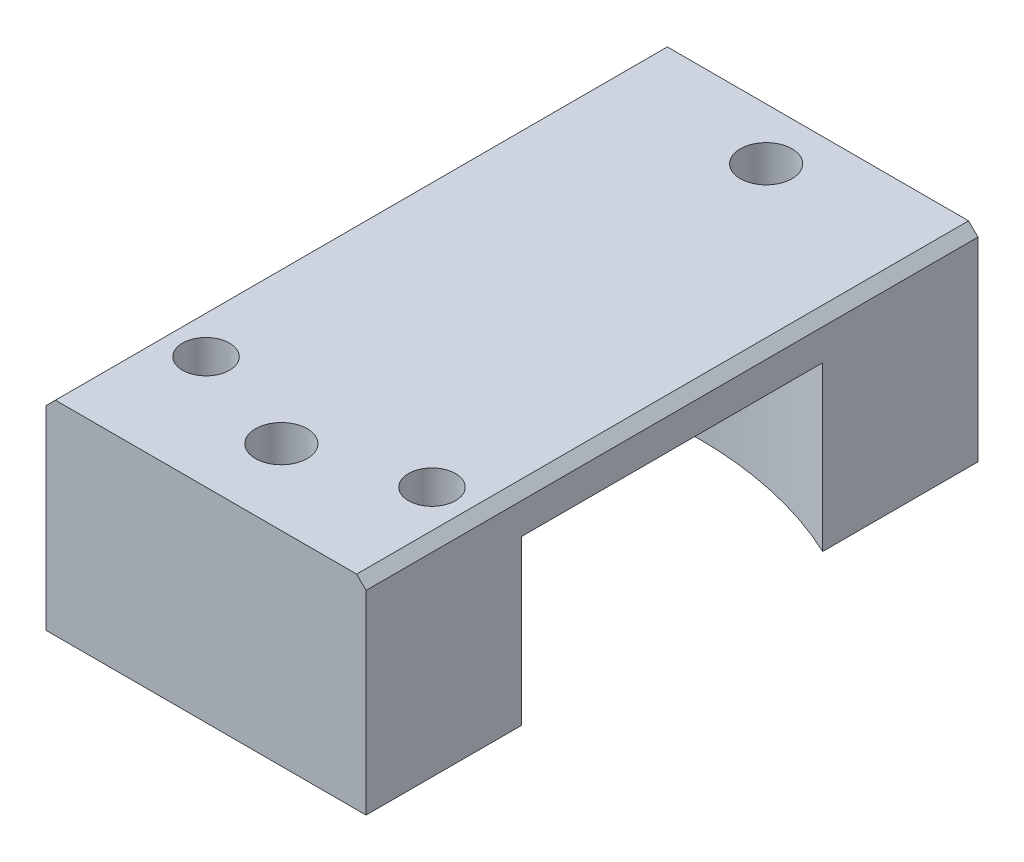
ISO-10303-21;
HEADER;
FILE_DESCRIPTION(('STEP AP214'),'2;1');
FILE_NAME('part.step','',(''),(''),'','','');
FILE_SCHEMA(('AUTOMOTIVE_DESIGN { 1 0 10303 214 1 1 1 1 }'));
ENDSEC;
DATA;
#1=APPLICATION_CONTEXT('core data for automotive mechanical design processes');
#2=APPLICATION_PROTOCOL_DEFINITION('international standard','automotive_design',2000,#1);
#3=PRODUCT_CONTEXT('',#1,'mechanical');
#4=PRODUCT('Part','Part','',(#3));
#5=PRODUCT_RELATED_PRODUCT_CATEGORY('part','',(#4));
#6=PRODUCT_DEFINITION_FORMATION('','',#4);
#7=PRODUCT_DEFINITION_CONTEXT('part definition',#1,'design');
#8=PRODUCT_DEFINITION('design','',#6,#7);
#9=PRODUCT_DEFINITION_SHAPE('','',#8);
#10=(LENGTH_UNIT() NAMED_UNIT(*) SI_UNIT(.MILLI.,.METRE.));
#11=(NAMED_UNIT(*) PLANE_ANGLE_UNIT() SI_UNIT($,.RADIAN.));
#12=(NAMED_UNIT(*) SI_UNIT($,.STERADIAN.) SOLID_ANGLE_UNIT());
#13=UNCERTAINTY_MEASURE_WITH_UNIT(LENGTH_MEASURE(1.E-05),#10,'distance_accuracy_value','');
#14=(GEOMETRIC_REPRESENTATION_CONTEXT(3) GLOBAL_UNCERTAINTY_ASSIGNED_CONTEXT((#13)) GLOBAL_UNIT_ASSIGNED_CONTEXT((#10,
#11,#12)) REPRESENTATION_CONTEXT('',''));
#15=CARTESIAN_POINT('',(0.,0.,0.));
#16=DIRECTION('',(0.,0.,1.));
#17=DIRECTION('',(1.,0.,0.));
#18=AXIS2_PLACEMENT_3D('',#15,#16,#17);
#19=CARTESIAN_POINT('',(0.,0.,65.));
#20=DIRECTION('',(0.,0.,1.));
#21=DIRECTION('',(1.,0.,0.));
#22=AXIS2_PLACEMENT_3D('',#19,#20,#21);
#23=PLANE('',#22);
#24=DIRECTION('',(0.,-1.,0.));
#25=VECTOR('',#24,1.);
#26=CARTESIAN_POINT('',(-17.,52.5,65.));
#27=LINE('',#26,#25);
#28=CARTESIAN_POINT('',(-17.,-29.,65.));
#29=VERTEX_POINT('',#28);
#30=CARTESIAN_POINT('',(-17.,-49.6714203541634,65.));
#31=VERTEX_POINT('',#30);
#32=EDGE_CURVE('E142',#29,#31,#27,.T.);
#33=ORIENTED_EDGE('',*,*,#32,.T.);
#34=DIRECTION('',(1.,0.,0.));
#35=VECTOR('',#34,1.);
#36=CARTESIAN_POINT('',(-17.,-49.6714203541634,65.));
#37=LINE('',#36,#35);
#38=CARTESIAN_POINT('',(17.,-49.6714203541634,65.));
#39=VERTEX_POINT('',#38);
#40=EDGE_CURVE('E124',#31,#39,#37,.T.);
#41=ORIENTED_EDGE('',*,*,#40,.T.);
#42=DIRECTION('',(0.,-1.,0.));
#43=VECTOR('',#42,1.);
#44=CARTESIAN_POINT('',(17.,52.5,65.));
#45=LINE('',#44,#43);
#46=CARTESIAN_POINT('',(17.,-29.,65.));
#47=VERTEX_POINT('',#46);
#48=EDGE_CURVE('E164',#47,#39,#45,.T.);
#49=ORIENTED_EDGE('',*,*,#48,.F.);
#50=DIRECTION('',(0.707106781186544,-0.707106781186551,0.));
#51=VECTOR('',#50,1.);
#52=CARTESIAN_POINT('',(-5.99999999999991,-5.99999999999985,65.));
#53=LINE('',#52,#51);
#54=CARTESIAN_POINT('',(16.,-28.,65.));
#55=VERTEX_POINT('',#54);
#56=EDGE_CURVE('E177',#47,#55,#53,.F.);
#57=ORIENTED_EDGE('',*,*,#56,.T.);
#58=DIRECTION('',(1.,0.,0.));
#59=VECTOR('',#58,1.);
#60=CARTESIAN_POINT('',(-17.,-28.,65.));
#61=LINE('',#60,#59);
#62=CARTESIAN_POINT('',(-16.,-28.,65.));
#63=VERTEX_POINT('',#62);
#64=EDGE_CURVE('E151',#63,#55,#61,.T.);
#65=ORIENTED_EDGE('',*,*,#64,.F.);
#66=DIRECTION('',(0.707106781186548,0.707106781186548,0.));
#67=VECTOR('',#66,1.);
#68=CARTESIAN_POINT('',(6.,-6.,65.));
#69=LINE('',#68,#67);
#70=EDGE_CURVE('E150',#63,#29,#69,.F.);
#71=ORIENTED_EDGE('',*,*,#70,.T.);
#72=EDGE_LOOP('',(#33,#41,#49,#57,#65,#71));
#73=FACE_BOUND('',#72,.T.);
#74=ADVANCED_FACE('F36',(#73),#23,.T.);
#75=CARTESIAN_POINT('',(0.,0.,0.));
#76=DIRECTION('',(0.,0.,1.));
#77=DIRECTION('',(1.,0.,0.));
#78=AXIS2_PLACEMENT_3D('',#75,#76,#77);
#79=PLANE('',#78);
#80=DIRECTION('',(-1.,0.,0.));
#81=VECTOR('',#80,1.);
#82=CARTESIAN_POINT('',(-17.,-49.6714203541634,0.));
#83=LINE('',#82,#81);
#84=CARTESIAN_POINT('',(17.,-49.6714203541634,0.));
#85=VERTEX_POINT('',#84);
#86=CARTESIAN_POINT('',(-17.,-49.6714203541634,0.));
#87=VERTEX_POINT('',#86);
#88=EDGE_CURVE('E134',#85,#87,#83,.T.);
#89=ORIENTED_EDGE('',*,*,#88,.T.);
#90=DIRECTION('',(0.,-1.,0.));
#91=VECTOR('',#90,1.);
#92=CARTESIAN_POINT('',(-17.,52.5,0.));
#93=LINE('',#92,#91);
#94=CARTESIAN_POINT('',(-17.,-29.,0.));
#95=VERTEX_POINT('',#94);
#96=EDGE_CURVE('E160',#95,#87,#93,.T.);
#97=ORIENTED_EDGE('',*,*,#96,.F.);
#98=DIRECTION('',(-0.707106781186548,-0.707106781186548,0.));
#99=VECTOR('',#98,1.);
#100=CARTESIAN_POINT('',(-17.,-29.,0.));
#101=LINE('',#100,#99);
#102=CARTESIAN_POINT('',(-16.,-28.,0.));
#103=VERTEX_POINT('',#102);
#104=EDGE_CURVE('E170',#95,#103,#101,.F.);
#105=ORIENTED_EDGE('',*,*,#104,.T.);
#106=DIRECTION('',(1.,0.,0.));
#107=VECTOR('',#106,1.);
#108=CARTESIAN_POINT('',(-17.,-28.,0.));
#109=LINE('',#108,#107);
#110=CARTESIAN_POINT('',(16.,-28.,0.));
#111=VERTEX_POINT('',#110);
#112=EDGE_CURVE('E156',#103,#111,#109,.T.);
#113=ORIENTED_EDGE('',*,*,#112,.T.);
#114=DIRECTION('',(-0.707106781186544,0.707106781186551,0.));
#115=VECTOR('',#114,1.);
#116=CARTESIAN_POINT('',(16.,-28.,0.));
#117=LINE('',#116,#115);
#118=CARTESIAN_POINT('',(17.,-29.,0.));
#119=VERTEX_POINT('',#118);
#120=EDGE_CURVE('E168',#111,#119,#117,.F.);
#121=ORIENTED_EDGE('',*,*,#120,.T.);
#122=DIRECTION('',(0.,-1.,0.));
#123=VECTOR('',#122,1.);
#124=CARTESIAN_POINT('',(17.,52.5,0.));
#125=LINE('',#124,#123);
#126=EDGE_CURVE('E146',#119,#85,#125,.T.);
#127=ORIENTED_EDGE('',*,*,#126,.T.);
#128=EDGE_LOOP('',(#89,#97,#105,#113,#121,#127));
#129=FACE_BOUND('',#128,.T.);
#130=ADVANCED_FACE('F189',(#129),#79,.F.);
#131=CARTESIAN_POINT('',(12.,-52.5,53.));
#132=DIRECTION('',(0.,-1.,0.));
#133=DIRECTION('',(0.,0.,-1.));
#134=AXIS2_PLACEMENT_3D('',#131,#132,#133);
#135=CYLINDRICAL_SURFACE('',#134,1.64999999999999);
#136=CARTESIAN_POINT('',(12.,-40.5107315261734,53.));
#137=DIRECTION('',(0.,1.,0.));
#138=DIRECTION('',(0.,0.,1.));
#139=AXIS2_PLACEMENT_3D('',#136,#137,#138);
#140=CIRCLE('',#139,1.64999999999999);
#141=CARTESIAN_POINT('',(12.,-40.5107315261734,54.65));
#142=VERTEX_POINT('',#141);
#143=EDGE_CURVE('E239',#142,#142,#140,.F.);
#144=ORIENTED_EDGE('',*,*,#143,.F.);
#145=EDGE_LOOP('',(#144));
#146=FACE_BOUND('',#145,.T.);
#147=CARTESIAN_POINT('',(12.,-49.6714203541634,53.));
#148=DIRECTION('',(0.,-1.,0.));
#149=DIRECTION('',(0.,0.,-1.));
#150=AXIS2_PLACEMENT_3D('',#147,#148,#149);
#151=CIRCLE('',#150,1.64999999999999);
#152=CARTESIAN_POINT('',(12.,-49.6714203541634,51.35));
#153=VERTEX_POINT('',#152);
#154=EDGE_CURVE('E216',#153,#153,#151,.F.);
#155=ORIENTED_EDGE('',*,*,#154,.F.);
#156=EDGE_LOOP('',(#155));
#157=FACE_BOUND('',#156,.T.);
#158=ADVANCED_FACE('F316',(#146,#157),#135,.F.);
#159=CARTESIAN_POINT('',(-12.,-52.5,53.));
#160=DIRECTION('',(0.,-1.,0.));
#161=DIRECTION('',(0.,0.,-1.));
#162=AXIS2_PLACEMENT_3D('',#159,#160,#161);
#163=CYLINDRICAL_SURFACE('',#162,1.64999999999999);
#164=CARTESIAN_POINT('',(-12.,-40.5107315261734,53.));
#165=DIRECTION('',(0.,1.,0.));
#166=DIRECTION('',(0.,0.,1.));
#167=AXIS2_PLACEMENT_3D('',#164,#165,#166);
#168=CIRCLE('',#167,1.64999999999999);
#169=CARTESIAN_POINT('',(-12.,-40.5107315261734,54.65));
#170=VERTEX_POINT('',#169);
#171=EDGE_CURVE('E236',#170,#170,#168,.F.);
#172=ORIENTED_EDGE('',*,*,#171,.F.);
#173=EDGE_LOOP('',(#172));
#174=FACE_BOUND('',#173,.T.);
#175=CARTESIAN_POINT('',(-12.,-49.6714203541634,53.));
#176=DIRECTION('',(0.,-1.,0.));
#177=DIRECTION('',(0.,0.,-1.));
#178=AXIS2_PLACEMENT_3D('',#175,#176,#177);
#179=CIRCLE('',#178,1.64999999999999);
#180=CARTESIAN_POINT('',(-12.,-49.6714203541634,51.35));
#181=VERTEX_POINT('',#180);
#182=EDGE_CURVE('E272',#181,#181,#179,.F.);
#183=ORIENTED_EDGE('',*,*,#182,.F.);
#184=EDGE_LOOP('',(#183));
#185=FACE_BOUND('',#184,.T.);
#186=ADVANCED_FACE('F346',(#174,#185),#163,.F.);
#187=CARTESIAN_POINT('',(0.,-52.5,57.));
#188=DIRECTION('',(0.,-1.,0.));
#189=DIRECTION('',(0.,0.,-1.));
#190=AXIS2_PLACEMENT_3D('',#187,#188,#189);
#191=CYLINDRICAL_SURFACE('',#190,5.);
#192=CARTESIAN_POINT('',(0.,-46.5,57.));
#193=DIRECTION('',(0.,-1.,0.));
#194=DIRECTION('',(0.,0.,-1.));
#195=AXIS2_PLACEMENT_3D('',#192,#193,#194);
#196=CIRCLE('',#195,5.);
#197=CARTESIAN_POINT('',(0.,-46.5,52.));
#198=VERTEX_POINT('',#197);
#199=EDGE_CURVE('E227',#198,#198,#196,.T.);
#200=ORIENTED_EDGE('',*,*,#199,.F.);
#201=EDGE_LOOP('',(#200));
#202=FACE_BOUND('',#201,.T.);
#203=CARTESIAN_POINT('',(0.,-49.6714203541634,57.));
#204=DIRECTION('',(0.,-1.,0.));
#205=DIRECTION('',(0.,0.,-1.));
#206=AXIS2_PLACEMENT_3D('',#203,#204,#205);
#207=CIRCLE('',#206,5.);
#208=CARTESIAN_POINT('',(0.,-49.6714203541634,52.));
#209=VERTEX_POINT('',#208);
#210=EDGE_CURVE('E269',#209,#209,#207,.F.);
#211=ORIENTED_EDGE('',*,*,#210,.F.);
#212=EDGE_LOOP('',(#211));
#213=FACE_BOUND('',#212,.T.);
#214=ADVANCED_FACE('F343',(#202,#213),#191,.F.);
#215=CARTESIAN_POINT('',(0.,-52.5,5.50000000000001));
#216=DIRECTION('',(0.,-1.,0.));
#217=DIRECTION('',(0.,0.,-1.));
#218=AXIS2_PLACEMENT_3D('',#215,#216,#217);
#219=CYLINDRICAL_SURFACE('',#218,5.);
#220=CARTESIAN_POINT('',(0.,-46.5,5.50000000000001));
#221=DIRECTION('',(0.,-1.,0.));
#222=DIRECTION('',(0.,0.,-1.));
#223=AXIS2_PLACEMENT_3D('',#220,#221,#222);
#224=CIRCLE('',#223,5.);
#225=CARTESIAN_POINT('',(0.,-46.5,0.500000000000007));
#226=VERTEX_POINT('',#225);
#227=EDGE_CURVE('E217',#226,#226,#224,.T.);
#228=ORIENTED_EDGE('',*,*,#227,.F.);
#229=EDGE_LOOP('',(#228));
#230=FACE_BOUND('',#229,.T.);
#231=CARTESIAN_POINT('',(0.,-49.6714203541634,5.50000000000001));
#232=DIRECTION('',(0.,-1.,0.));
#233=DIRECTION('',(0.,0.,-1.));
#234=AXIS2_PLACEMENT_3D('',#231,#232,#233);
#235=CIRCLE('',#234,5.);
#236=CARTESIAN_POINT('',(0.,-49.6714203541634,0.500000000000009));
#237=VERTEX_POINT('',#236);
#238=EDGE_CURVE('E266',#237,#237,#235,.F.);
#239=ORIENTED_EDGE('',*,*,#238,.F.);
#240=EDGE_LOOP('',(#239));
#241=FACE_BOUND('',#240,.T.);
#242=ADVANCED_FACE('F340',(#230,#241),#219,.F.);
#243=CARTESIAN_POINT('',(-25.2546995306986,17.0668543337863,9.36101769772386));
#244=DIRECTION('',(0.,-1.,0.));
#245=DIRECTION('',(0.,0.,-1.));
#246=AXIS2_PLACEMENT_3D('',#243,#244,#245);
#247=CYLINDRICAL_SURFACE('',#246,40.);
#248=DIRECTION('',(0.,-1.,0.));
#249=VECTOR('',#248,1.);
#250=CARTESIAN_POINT('',(-6.88764532655415,17.0668543337863,44.8948230084701));
#251=LINE('',#250,#249);
#252=CARTESIAN_POINT('',(-6.88764532655415,-32.3,44.8948230084701));
#253=VERTEX_POINT('',#252);
#254=CARTESIAN_POINT('',(-6.88764532655415,-49.6714203541634,44.8948230084701));
#255=VERTEX_POINT('',#254);
#256=EDGE_CURVE('E208',#253,#255,#251,.T.);
#257=ORIENTED_EDGE('',*,*,#256,.T.);
#258=CARTESIAN_POINT('',(-25.2546995306986,-49.6714203541634,9.36101769772386));
#259=DIRECTION('',(0.,-1.,0.));
#260=DIRECTION('',(0.,0.,-1.));
#261=AXIS2_PLACEMENT_3D('',#258,#259,#260);
#262=CIRCLE('',#261,40.);
#263=CARTESIAN_POINT('',(-17.,-49.6714203541634,48.5));
#264=VERTEX_POINT('',#263);
#265=EDGE_CURVE('E264',#255,#264,#262,.T.);
#266=ORIENTED_EDGE('',*,*,#265,.T.);
#267=DIRECTION('',(0.,-1.,0.));
#268=VECTOR('',#267,1.);
#269=CARTESIAN_POINT('',(-17.,17.0668543337863,48.5));
#270=LINE('',#269,#268);
#271=CARTESIAN_POINT('',(-17.,-32.3,48.5));
#272=VERTEX_POINT('',#271);
#273=EDGE_CURVE('E144',#272,#264,#270,.T.);
#274=ORIENTED_EDGE('',*,*,#273,.F.);
#275=CARTESIAN_POINT('',(-25.2546995306986,-32.3,9.36101769772386));
#276=DIRECTION('',(0.,1.,0.));
#277=DIRECTION('',(0.,0.,1.));
#278=AXIS2_PLACEMENT_3D('',#275,#276,#277);
#279=CIRCLE('',#278,40.);
#280=EDGE_CURVE('E285',#272,#253,#279,.T.);
#281=ORIENTED_EDGE('',*,*,#280,.T.);
#282=EDGE_LOOP('',(#257,#266,#274,#281));
#283=FACE_BOUND('',#282,.T.);
#284=ADVANCED_FACE('F291',(#283),#247,.F.);
#285=CARTESIAN_POINT('',(0.,17.0668543337863,58.22));
#286=DIRECTION('',(0.,-1.,0.));
#287=DIRECTION('',(0.,0.,-1.));
#288=AXIS2_PLACEMENT_3D('',#285,#286,#287);
#289=CYLINDRICAL_SURFACE('',#288,15.);
#290=DIRECTION('',(0.,-1.,0.));
#291=VECTOR('',#290,1.);
#292=CARTESIAN_POINT('',(6.88764532655415,17.0668543337863,44.8948230084701));
#293=LINE('',#292,#291);
#294=CARTESIAN_POINT('',(6.88764532655415,-32.3,44.8948230084701));
#295=VERTEX_POINT('',#294);
#296=CARTESIAN_POINT('',(6.88764532655415,-49.6714203541634,44.8948230084701));
#297=VERTEX_POINT('',#296);
#298=EDGE_CURVE('E203',#295,#297,#293,.T.);
#299=ORIENTED_EDGE('',*,*,#298,.T.);
#300=CARTESIAN_POINT('',(0.,-49.6714203541634,58.22));
#301=DIRECTION('',(0.,-1.,0.));
#302=DIRECTION('',(0.,0.,-1.));
#303=AXIS2_PLACEMENT_3D('',#300,#301,#302);
#304=CIRCLE('',#303,15.);
#305=EDGE_CURVE('E51',#297,#255,#304,.F.);
#306=ORIENTED_EDGE('',*,*,#305,.T.);
#307=ORIENTED_EDGE('',*,*,#256,.F.);
#308=CARTESIAN_POINT('',(0.,-32.3,58.22));
#309=DIRECTION('',(0.,1.,0.));
#310=DIRECTION('',(0.,0.,1.));
#311=AXIS2_PLACEMENT_3D('',#308,#309,#310);
#312=CIRCLE('',#311,15.);
#313=EDGE_CURVE('E282',#253,#295,#312,.F.);
#314=ORIENTED_EDGE('',*,*,#313,.T.);
#315=EDGE_LOOP('',(#299,#306,#307,#314));
#316=FACE_BOUND('',#315,.T.);
#317=ADVANCED_FACE('F294',(#316),#289,.T.);
#318=CARTESIAN_POINT('',(25.2546995306985,17.0668543337863,9.36101769772386));
#319=DIRECTION('',(0.,-1.,0.));
#320=DIRECTION('',(0.,0.,-1.));
#321=AXIS2_PLACEMENT_3D('',#318,#319,#320);
#322=CYLINDRICAL_SURFACE('',#321,40.);
#323=DIRECTION('',(0.,-1.,0.));
#324=VECTOR('',#323,1.);
#325=CARTESIAN_POINT('',(17.,17.0668543337863,48.5));
#326=LINE('',#325,#324);
#327=CARTESIAN_POINT('',(17.,-32.3,48.5));
#328=VERTEX_POINT('',#327);
#329=CARTESIAN_POINT('',(17.,-49.6714203541634,48.5));
#330=VERTEX_POINT('',#329);
#331=EDGE_CURVE('E199',#328,#330,#326,.T.);
#332=ORIENTED_EDGE('',*,*,#331,.T.);
#333=CARTESIAN_POINT('',(25.2546995306985,-49.6714203541634,9.36101769772386));
#334=DIRECTION('',(0.,-1.,0.));
#335=DIRECTION('',(0.,0.,-1.));
#336=AXIS2_PLACEMENT_3D('',#333,#334,#335);
#337=CIRCLE('',#336,40.);
#338=EDGE_CURVE('E259',#330,#297,#337,.T.);
#339=ORIENTED_EDGE('',*,*,#338,.T.);
#340=ORIENTED_EDGE('',*,*,#298,.F.);
#341=CARTESIAN_POINT('',(25.2546995306985,-32.3,9.36101769772386));
#342=DIRECTION('',(0.,1.,0.));
#343=DIRECTION('',(0.,0.,1.));
#344=AXIS2_PLACEMENT_3D('',#341,#342,#343);
#345=CIRCLE('',#344,40.);
#346=EDGE_CURVE('E280',#295,#328,#345,.T.);
#347=ORIENTED_EDGE('',*,*,#346,.T.);
#348=EDGE_LOOP('',(#332,#339,#340,#347));
#349=FACE_BOUND('',#348,.T.);
#350=ADVANCED_FACE('F296',(#349),#322,.F.);
#351=CARTESIAN_POINT('',(0.,17.0668543337863,52.7077339804634));
#352=DIRECTION('',(0.,-1.,0.));
#353=DIRECTION('',(0.,0.,-1.));
#354=AXIS2_PLACEMENT_3D('',#351,#352,#353);
#355=CYLINDRICAL_SURFACE('',#354,40.);
#356=DIRECTION('',(0.,-1.,0.));
#357=VECTOR('',#356,1.);
#358=CARTESIAN_POINT('',(-17.,17.0668543337863,16.5));
#359=LINE('',#358,#357);
#360=CARTESIAN_POINT('',(-17.,-32.3,16.5));
#361=VERTEX_POINT('',#360);
#362=CARTESIAN_POINT('',(-17.,-49.6714203541634,16.5));
#363=VERTEX_POINT('',#362);
#364=EDGE_CURVE('E205',#361,#363,#359,.T.);
#365=ORIENTED_EDGE('',*,*,#364,.T.);
#366=CARTESIAN_POINT('',(0.,-49.6714203541634,52.7077339804634));
#367=DIRECTION('',(0.,-1.,0.));
#368=DIRECTION('',(0.,0.,-1.));
#369=AXIS2_PLACEMENT_3D('',#366,#367,#368);
#370=CIRCLE('',#369,40.);
#371=CARTESIAN_POINT('',(17.,-49.6714203541634,16.5));
#372=VERTEX_POINT('',#371);
#373=EDGE_CURVE('E11',#363,#372,#370,.T.);
#374=ORIENTED_EDGE('',*,*,#373,.T.);
#375=DIRECTION('',(0.,-1.,0.));
#376=VECTOR('',#375,1.);
#377=CARTESIAN_POINT('',(17.,17.0668543337863,16.5));
#378=LINE('',#377,#376);
#379=CARTESIAN_POINT('',(17.,-32.3,16.5));
#380=VERTEX_POINT('',#379);
#381=EDGE_CURVE('E195',#380,#372,#378,.T.);
#382=ORIENTED_EDGE('',*,*,#381,.F.);
#383=CARTESIAN_POINT('',(0.,-32.3,52.7077339804634));
#384=DIRECTION('',(0.,1.,0.));
#385=DIRECTION('',(0.,0.,1.));
#386=AXIS2_PLACEMENT_3D('',#383,#384,#385);
#387=CIRCLE('',#386,40.);
#388=EDGE_CURVE('E221',#380,#361,#387,.T.);
#389=ORIENTED_EDGE('',*,*,#388,.T.);
#390=EDGE_LOOP('',(#365,#374,#382,#389));
#391=FACE_BOUND('',#390,.T.);
#392=ADVANCED_FACE('F300',(#391),#355,.F.);
#393=CARTESIAN_POINT('',(-17.,52.5,65.));
#394=DIRECTION('',(-1.,0.,0.));
#395=DIRECTION('',(0.,0.,1.));
#396=AXIS2_PLACEMENT_3D('',#393,#394,#395);
#397=PLANE('',#396);
#398=DIRECTION('',(0.,0.,1.));
#399=VECTOR('',#398,1.);
#400=CARTESIAN_POINT('',(-17.,-32.3,16.5));
#401=LINE('',#400,#399);
#402=EDGE_CURVE('E214',#361,#272,#401,.T.);
#403=ORIENTED_EDGE('',*,*,#402,.T.);
#404=ORIENTED_EDGE('',*,*,#273,.T.);
#405=DIRECTION('',(0.,0.,-1.));
#406=VECTOR('',#405,1.);
#407=CARTESIAN_POINT('',(-17.,-49.6714203541634,65.));
#408=LINE('',#407,#406);
#409=EDGE_CURVE('E128',#264,#31,#408,.F.);
#410=ORIENTED_EDGE('',*,*,#409,.T.);
#411=ORIENTED_EDGE('',*,*,#32,.F.);
#412=DIRECTION('',(0.,0.,-1.));
#413=VECTOR('',#412,1.);
#414=CARTESIAN_POINT('',(-17.,-29.,65.));
#415=LINE('',#414,#413);
#416=EDGE_CURVE('E166',#29,#95,#415,.T.);
#417=ORIENTED_EDGE('',*,*,#416,.T.);
#418=ORIENTED_EDGE('',*,*,#96,.T.);
#419=EDGE_CURVE('E145',#87,#363,#408,.F.);
#420=ORIENTED_EDGE('',*,*,#419,.T.);
#421=ORIENTED_EDGE('',*,*,#364,.F.);
#422=EDGE_LOOP('',(#403,#404,#410,#411,#417,#418,#420,#421));
#423=FACE_BOUND('',#422,.T.);
#424=ADVANCED_FACE('F140',(#423),#397,.T.);
#425=CARTESIAN_POINT('',(17.,52.5,65.));
#426=DIRECTION('',(1.,0.,0.));
#427=DIRECTION('',(0.,0.,-1.));
#428=AXIS2_PLACEMENT_3D('',#425,#426,#427);
#429=PLANE('',#428);
#430=DIRECTION('',(0.,0.,-1.));
#431=VECTOR('',#430,1.);
#432=CARTESIAN_POINT('',(17.,-49.6714203541634,65.));
#433=LINE('',#432,#431);
#434=EDGE_CURVE('E131',#39,#330,#433,.T.);
#435=ORIENTED_EDGE('',*,*,#434,.T.);
#436=ORIENTED_EDGE('',*,*,#331,.F.);
#437=DIRECTION('',(0.,0.,-1.));
#438=VECTOR('',#437,1.);
#439=CARTESIAN_POINT('',(17.,-32.3,48.5));
#440=LINE('',#439,#438);
#441=EDGE_CURVE('E200',#328,#380,#440,.T.);
#442=ORIENTED_EDGE('',*,*,#441,.T.);
#443=ORIENTED_EDGE('',*,*,#381,.T.);
#444=EDGE_CURVE('E162',#372,#85,#433,.T.);
#445=ORIENTED_EDGE('',*,*,#444,.T.);
#446=ORIENTED_EDGE('',*,*,#126,.F.);
#447=DIRECTION('',(0.,0.,1.));
#448=VECTOR('',#447,1.);
#449=CARTESIAN_POINT('',(17.,-29.,65.));
#450=LINE('',#449,#448);
#451=EDGE_CURVE('E44',#119,#47,#450,.T.);
#452=ORIENTED_EDGE('',*,*,#451,.T.);
#453=ORIENTED_EDGE('',*,*,#48,.T.);
#454=EDGE_LOOP('',(#435,#436,#442,#443,#445,#446,#452,#453));
#455=FACE_BOUND('',#454,.T.);
#456=ADVANCED_FACE('F191',(#455),#429,.T.);
#457=CARTESIAN_POINT('',(-17.,-28.,65.));
#458=DIRECTION('',(0.,1.,0.));
#459=DIRECTION('',(0.,0.,1.));
#460=AXIS2_PLACEMENT_3D('',#457,#458,#459);
#461=PLANE('',#460);
#462=CARTESIAN_POINT('',(0.,-28.,5.50000000000001));
#463=DIRECTION('',(0.,-1.,0.));
#464=DIRECTION('',(0.,0.,-1.));
#465=AXIS2_PLACEMENT_3D('',#462,#463,#464);
#466=CIRCLE('',#465,2.74999999999999);
#467=CARTESIAN_POINT('',(0.,-28.,2.75000000000001));
#468=VERTEX_POINT('',#467);
#469=EDGE_CURVE('E224',#468,#468,#466,.T.);
#470=ORIENTED_EDGE('',*,*,#469,.T.);
#471=EDGE_LOOP('',(#470));
#472=FACE_BOUND('',#471,.T.);
#473=CARTESIAN_POINT('',(0.,-28.,57.));
#474=DIRECTION('',(0.,-1.,0.));
#475=DIRECTION('',(0.,0.,-1.));
#476=AXIS2_PLACEMENT_3D('',#473,#474,#475);
#477=CIRCLE('',#476,2.74999999999999);
#478=CARTESIAN_POINT('',(0.,-28.,54.25));
#479=VERTEX_POINT('',#478);
#480=EDGE_CURVE('E233',#479,#479,#477,.T.);
#481=ORIENTED_EDGE('',*,*,#480,.T.);
#482=EDGE_LOOP('',(#481));
#483=FACE_BOUND('',#482,.T.);
#484=CARTESIAN_POINT('',(12.,-28.,53.));
#485=DIRECTION('',(0.,1.,0.));
#486=DIRECTION('',(0.,0.,1.));
#487=AXIS2_PLACEMENT_3D('',#484,#485,#486);
#488=CIRCLE('',#487,2.5);
#489=CARTESIAN_POINT('',(12.,-28.,55.5));
#490=VERTEX_POINT('',#489);
#491=EDGE_CURVE('E242',#490,#490,#488,.T.);
#492=ORIENTED_EDGE('',*,*,#491,.F.);
#493=EDGE_LOOP('',(#492));
#494=FACE_BOUND('',#493,.T.);
#495=CARTESIAN_POINT('',(-12.,-28.,53.));
#496=DIRECTION('',(0.,1.,0.));
#497=DIRECTION('',(0.,0.,1.));
#498=AXIS2_PLACEMENT_3D('',#495,#496,#497);
#499=CIRCLE('',#498,2.5);
#500=CARTESIAN_POINT('',(-12.,-28.,55.5));
#501=VERTEX_POINT('',#500);
#502=EDGE_CURVE('E248',#501,#501,#499,.T.);
#503=ORIENTED_EDGE('',*,*,#502,.F.);
#504=EDGE_LOOP('',(#503));
#505=FACE_BOUND('',#504,.T.);
#506=ORIENTED_EDGE('',*,*,#112,.F.);
#507=DIRECTION('',(0.,0.,1.));
#508=VECTOR('',#507,1.);
#509=CARTESIAN_POINT('',(-16.,-28.,65.));
#510=LINE('',#509,#508);
#511=EDGE_CURVE('E175',#103,#63,#510,.T.);
#512=ORIENTED_EDGE('',*,*,#511,.T.);
#513=ORIENTED_EDGE('',*,*,#64,.T.);
#514=DIRECTION('',(0.,0.,-1.));
#515=VECTOR('',#514,1.);
#516=CARTESIAN_POINT('',(16.,-28.,65.));
#517=LINE('',#516,#515);
#518=EDGE_CURVE('E172',#55,#111,#517,.T.);
#519=ORIENTED_EDGE('',*,*,#518,.T.);
#520=EDGE_LOOP('',(#506,#512,#513,#519));
#521=FACE_BOUND('',#520,.T.);
#522=ADVANCED_FACE('F184',(#472,#483,#494,#505,#521),#461,.T.);
#523=CARTESIAN_POINT('',(-12.,-40.,53.));
#524=DIRECTION('',(0.,1.,0.));
#525=DIRECTION('',(0.,0.,1.));
#526=AXIS2_PLACEMENT_3D('',#523,#524,#525);
#527=CONICAL_SURFACE('',#526,2.5,1.02974425867665);
#528=ORIENTED_EDGE('',*,*,#171,.T.);
#529=EDGE_LOOP('',(#528));
#530=FACE_BOUND('',#529,.T.);
#531=CARTESIAN_POINT('',(-12.,-40.,53.));
#532=DIRECTION('',(0.,1.,0.));
#533=DIRECTION('',(0.,0.,1.));
#534=AXIS2_PLACEMENT_3D('',#531,#532,#533);
#535=CIRCLE('',#534,2.5);
#536=CARTESIAN_POINT('',(-12.,-40.,55.5));
#537=VERTEX_POINT('',#536);
#538=EDGE_CURVE('E251',#537,#537,#535,.T.);
#539=ORIENTED_EDGE('',*,*,#538,.T.);
#540=EDGE_LOOP('',(#539));
#541=FACE_BOUND('',#540,.T.);
#542=ADVANCED_FACE('F372',(#530,#541),#527,.F.);
#543=CARTESIAN_POINT('',(-12.,-28.,53.));
#544=DIRECTION('',(0.,1.,0.));
#545=DIRECTION('',(0.,0.,1.));
#546=AXIS2_PLACEMENT_3D('',#543,#544,#545);
#547=CYLINDRICAL_SURFACE('',#546,2.5);
#548=ORIENTED_EDGE('',*,*,#538,.F.);
#549=EDGE_LOOP('',(#548));
#550=FACE_BOUND('',#549,.T.);
#551=ORIENTED_EDGE('',*,*,#502,.T.);
#552=EDGE_LOOP('',(#551));
#553=FACE_BOUND('',#552,.T.);
#554=ADVANCED_FACE('F368',(#550,#553),#547,.F.);
#555=CARTESIAN_POINT('',(12.,-40.,53.));
#556=DIRECTION('',(0.,1.,0.));
#557=DIRECTION('',(0.,0.,1.));
#558=AXIS2_PLACEMENT_3D('',#555,#556,#557);
#559=CONICAL_SURFACE('',#558,2.5,1.02974425867665);
#560=ORIENTED_EDGE('',*,*,#143,.T.);
#561=EDGE_LOOP('',(#560));
#562=FACE_BOUND('',#561,.T.);
#563=CARTESIAN_POINT('',(12.,-40.,53.));
#564=DIRECTION('',(0.,1.,0.));
#565=DIRECTION('',(0.,0.,1.));
#566=AXIS2_PLACEMENT_3D('',#563,#564,#565);
#567=CIRCLE('',#566,2.5);
#568=CARTESIAN_POINT('',(12.,-40.,55.5));
#569=VERTEX_POINT('',#568);
#570=EDGE_CURVE('E245',#569,#569,#567,.T.);
#571=ORIENTED_EDGE('',*,*,#570,.T.);
#572=EDGE_LOOP('',(#571));
#573=FACE_BOUND('',#572,.T.);
#574=ADVANCED_FACE('F364',(#562,#573),#559,.F.);
#575=CARTESIAN_POINT('',(12.,-28.,53.));
#576=DIRECTION('',(0.,1.,0.));
#577=DIRECTION('',(0.,0.,1.));
#578=AXIS2_PLACEMENT_3D('',#575,#576,#577);
#579=CYLINDRICAL_SURFACE('',#578,2.5);
#580=ORIENTED_EDGE('',*,*,#570,.F.);
#581=EDGE_LOOP('',(#580));
#582=FACE_BOUND('',#581,.T.);
#583=ORIENTED_EDGE('',*,*,#491,.T.);
#584=EDGE_LOOP('',(#583));
#585=FACE_BOUND('',#584,.T.);
#586=ADVANCED_FACE('F354',(#582,#585),#579,.F.);
#587=CARTESIAN_POINT('',(0.,-52.5,57.));
#588=DIRECTION('',(0.,-1.,0.));
#589=DIRECTION('',(0.,0.,-1.));
#590=AXIS2_PLACEMENT_3D('',#587,#588,#589);
#591=CYLINDRICAL_SURFACE('',#590,2.75);
#592=ORIENTED_EDGE('',*,*,#480,.F.);
#593=EDGE_LOOP('',(#592));
#594=FACE_BOUND('',#593,.T.);
#595=CARTESIAN_POINT('',(0.,-46.5,57.));
#596=DIRECTION('',(0.,-1.,0.));
#597=DIRECTION('',(0.,0.,-1.));
#598=AXIS2_PLACEMENT_3D('',#595,#596,#597);
#599=CIRCLE('',#598,2.75);
#600=CARTESIAN_POINT('',(0.,-46.5,54.25));
#601=VERTEX_POINT('',#600);
#602=EDGE_CURVE('E230',#601,#601,#599,.T.);
#603=ORIENTED_EDGE('',*,*,#602,.T.);
#604=EDGE_LOOP('',(#603));
#605=FACE_BOUND('',#604,.T.);
#606=ADVANCED_FACE('F350',(#594,#605),#591,.F.);
#607=CARTESIAN_POINT('',(2.75,-46.5,57.));
#608=DIRECTION('',(0.,1.,0.));
#609=DIRECTION('',(0.,0.,1.));
#610=AXIS2_PLACEMENT_3D('',#607,#608,#609);
#611=PLANE('',#610);
#612=ORIENTED_EDGE('',*,*,#602,.F.);
#613=EDGE_LOOP('',(#612));
#614=FACE_BOUND('',#613,.T.);
#615=ORIENTED_EDGE('',*,*,#199,.T.);
#616=EDGE_LOOP('',(#615));
#617=FACE_BOUND('',#616,.T.);
#618=ADVANCED_FACE('F334',(#614,#617),#611,.F.);
#619=CARTESIAN_POINT('',(0.,-52.5,5.50000000000001));
#620=DIRECTION('',(0.,-1.,0.));
#621=DIRECTION('',(0.,0.,-1.));
#622=AXIS2_PLACEMENT_3D('',#619,#620,#621);
#623=CYLINDRICAL_SURFACE('',#622,2.75);
#624=ORIENTED_EDGE('',*,*,#469,.F.);
#625=EDGE_LOOP('',(#624));
#626=FACE_BOUND('',#625,.T.);
#627=CARTESIAN_POINT('',(0.,-46.5,5.50000000000001));
#628=DIRECTION('',(0.,-1.,0.));
#629=DIRECTION('',(0.,0.,-1.));
#630=AXIS2_PLACEMENT_3D('',#627,#628,#629);
#631=CIRCLE('',#630,2.75);
#632=CARTESIAN_POINT('',(0.,-46.5,2.75));
#633=VERTEX_POINT('',#632);
#634=EDGE_CURVE('E220',#633,#633,#631,.T.);
#635=ORIENTED_EDGE('',*,*,#634,.T.);
#636=EDGE_LOOP('',(#635));
#637=FACE_BOUND('',#636,.T.);
#638=ADVANCED_FACE('F328',(#626,#637),#623,.F.);
#639=CARTESIAN_POINT('',(2.75,-46.5,5.50000000000001));
#640=DIRECTION('',(0.,1.,0.));
#641=DIRECTION('',(0.,0.,1.));
#642=AXIS2_PLACEMENT_3D('',#639,#640,#641);
#643=PLANE('',#642);
#644=ORIENTED_EDGE('',*,*,#634,.F.);
#645=EDGE_LOOP('',(#644));
#646=FACE_BOUND('',#645,.T.);
#647=ORIENTED_EDGE('',*,*,#227,.T.);
#648=EDGE_LOOP('',(#647));
#649=FACE_BOUND('',#648,.T.);
#650=ADVANCED_FACE('F322',(#646,#649),#643,.F.);
#651=CARTESIAN_POINT('',(-17.,-29.,65.));
#652=DIRECTION('',(0.707106781186547,-0.707106781186547,0.));
#653=DIRECTION('',(0.,0.,-1.));
#654=AXIS2_PLACEMENT_3D('',#651,#652,#653);
#655=PLANE('',#654);
#656=ORIENTED_EDGE('',*,*,#70,.F.);
#657=ORIENTED_EDGE('',*,*,#511,.F.);
#658=ORIENTED_EDGE('',*,*,#104,.F.);
#659=ORIENTED_EDGE('',*,*,#416,.F.);
#660=EDGE_LOOP('',(#656,#657,#658,#659));
#661=FACE_BOUND('',#660,.T.);
#662=ADVANCED_FACE('F320',(#661),#655,.F.);
#663=CARTESIAN_POINT('',(16.,-28.,65.));
#664=DIRECTION('',(-0.707106781186551,-0.707106781186544,0.));
#665=DIRECTION('',(0.,0.,-1.));
#666=AXIS2_PLACEMENT_3D('',#663,#664,#665);
#667=PLANE('',#666);
#668=ORIENTED_EDGE('',*,*,#56,.F.);
#669=ORIENTED_EDGE('',*,*,#451,.F.);
#670=ORIENTED_EDGE('',*,*,#120,.F.);
#671=ORIENTED_EDGE('',*,*,#518,.F.);
#672=EDGE_LOOP('',(#668,#669,#670,#671));
#673=FACE_BOUND('',#672,.T.);
#674=ADVANCED_FACE('F38',(#673),#667,.F.);
#675=CARTESIAN_POINT('',(0.,-32.3,0.));
#676=DIRECTION('',(0.,1.,0.));
#677=DIRECTION('',(0.,0.,1.));
#678=AXIS2_PLACEMENT_3D('',#675,#676,#677);
#679=PLANE('',#678);
#680=ORIENTED_EDGE('',*,*,#402,.F.);
#681=ORIENTED_EDGE('',*,*,#388,.F.);
#682=ORIENTED_EDGE('',*,*,#441,.F.);
#683=ORIENTED_EDGE('',*,*,#346,.F.);
#684=ORIENTED_EDGE('',*,*,#313,.F.);
#685=ORIENTED_EDGE('',*,*,#280,.F.);
#686=EDGE_LOOP('',(#680,#681,#682,#683,#684,#685));
#687=FACE_BOUND('',#686,.T.);
#688=ADVANCED_FACE('F298',(#687),#679,.F.);
#689=CARTESIAN_POINT('',(0.,-49.6714203541634,0.));
#690=DIRECTION('',(0.,-1.,0.));
#691=DIRECTION('',(0.,0.,-1.));
#692=AXIS2_PLACEMENT_3D('',#689,#690,#691);
#693=PLANE('',#692);
#694=ORIENTED_EDGE('',*,*,#419,.F.);
#695=ORIENTED_EDGE('',*,*,#88,.F.);
#696=ORIENTED_EDGE('',*,*,#444,.F.);
#697=ORIENTED_EDGE('',*,*,#373,.F.);
#698=EDGE_LOOP('',(#694,#695,#696,#697));
#699=FACE_BOUND('',#698,.T.);
#700=ORIENTED_EDGE('',*,*,#238,.T.);
#701=EDGE_LOOP('',(#700));
#702=FACE_BOUND('',#701,.T.);
#703=ADVANCED_FACE('F257',(#699,#702),#693,.T.);
#704=ORIENTED_EDGE('',*,*,#305,.F.);
#705=ORIENTED_EDGE('',*,*,#338,.F.);
#706=ORIENTED_EDGE('',*,*,#434,.F.);
#707=ORIENTED_EDGE('',*,*,#40,.F.);
#708=ORIENTED_EDGE('',*,*,#409,.F.);
#709=ORIENTED_EDGE('',*,*,#265,.F.);
#710=EDGE_LOOP('',(#704,#705,#706,#707,#708,#709));
#711=FACE_BOUND('',#710,.T.);
#712=ORIENTED_EDGE('',*,*,#210,.T.);
#713=EDGE_LOOP('',(#712));
#714=FACE_BOUND('',#713,.T.);
#715=ORIENTED_EDGE('',*,*,#182,.T.);
#716=EDGE_LOOP('',(#715));
#717=FACE_BOUND('',#716,.T.);
#718=ORIENTED_EDGE('',*,*,#154,.T.);
#719=EDGE_LOOP('',(#718));
#720=FACE_BOUND('',#719,.T.);
#721=ADVANCED_FACE('F126',(#711,#714,#717,#720),#693,.T.);
#722=CLOSED_SHELL('',(#74,#130,#158,#186,#214,#242,#284,#317,#350,#392,#424,#456,#522,#542,#554,
#574,#586,#606,#618,#638,#650,#662,#674,#688,#703,#721));
#723=MANIFOLD_SOLID_BREP('B2',#722);
#724=ADVANCED_BREP_SHAPE_REPRESENTATION('',(#18,#723),#14);
#725=SHAPE_DEFINITION_REPRESENTATION(#9,#724);
ENDSEC;
END-ISO-10303-21;
